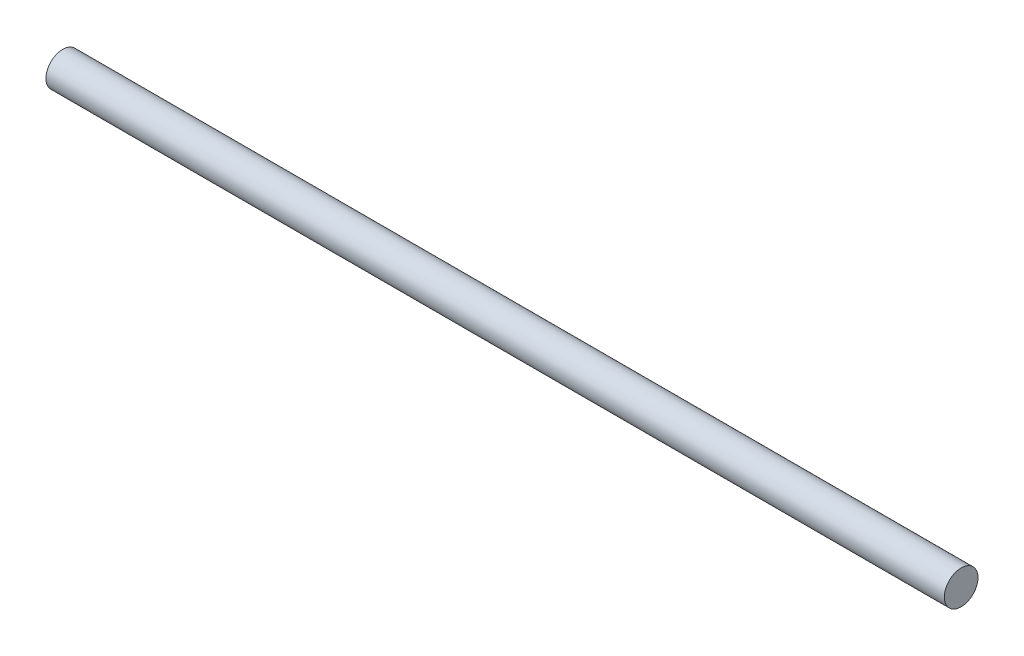
ISO-10303-21;
HEADER;
FILE_DESCRIPTION(('STEP AP214'),'2;1');
FILE_NAME('part.step','',(''),(''),'','','');
FILE_SCHEMA(('AUTOMOTIVE_DESIGN { 1 0 10303 214 1 1 1 1 }'));
ENDSEC;
DATA;
#1=APPLICATION_CONTEXT('core data for automotive mechanical design processes');
#2=APPLICATION_PROTOCOL_DEFINITION('international standard','automotive_design',2000,#1);
#3=PRODUCT_CONTEXT('',#1,'mechanical');
#4=PRODUCT('Part','Part','',(#3));
#5=PRODUCT_RELATED_PRODUCT_CATEGORY('part','',(#4));
#6=PRODUCT_DEFINITION_FORMATION('','',#4);
#7=PRODUCT_DEFINITION_CONTEXT('part definition',#1,'design');
#8=PRODUCT_DEFINITION('design','',#6,#7);
#9=PRODUCT_DEFINITION_SHAPE('','',#8);
#10=(LENGTH_UNIT() NAMED_UNIT(*) SI_UNIT(.MILLI.,.METRE.));
#11=(NAMED_UNIT(*) PLANE_ANGLE_UNIT() SI_UNIT($,.RADIAN.));
#12=(NAMED_UNIT(*) SI_UNIT($,.STERADIAN.) SOLID_ANGLE_UNIT());
#13=UNCERTAINTY_MEASURE_WITH_UNIT(LENGTH_MEASURE(1.E-05),#10,'distance_accuracy_value','');
#14=(GEOMETRIC_REPRESENTATION_CONTEXT(3) GLOBAL_UNCERTAINTY_ASSIGNED_CONTEXT((#13)) GLOBAL_UNIT_ASSIGNED_CONTEXT((#10,
#11,#12)) REPRESENTATION_CONTEXT('',''));
#15=CARTESIAN_POINT('',(0.,0.,0.));
#16=DIRECTION('',(0.,0.,1.));
#17=DIRECTION('',(1.,0.,0.));
#18=AXIS2_PLACEMENT_3D('',#15,#16,#17);
#19=CARTESIAN_POINT('',(0.,0.,0.));
#20=DIRECTION('',(1.,0.,0.));
#21=DIRECTION('',(0.,0.,-1.));
#22=AXIS2_PLACEMENT_3D('',#19,#20,#21);
#23=PLANE('',#22);
#24=CARTESIAN_POINT('',(0.,0.,0.));
#25=DIRECTION('',(1.,0.,0.));
#26=DIRECTION('',(0.,0.,-1.));
#27=AXIS2_PLACEMENT_3D('',#24,#25,#26);
#28=CIRCLE('',#27,0.1905);
#29=CARTESIAN_POINT('',(0.,0.,-0.1905));
#30=VERTEX_POINT('',#29);
#31=EDGE_CURVE('E43',#30,#30,#28,.T.);
#32=ORIENTED_EDGE('',*,*,#31,.F.);
#33=EDGE_LOOP('',(#32));
#34=FACE_BOUND('',#33,.T.);
#35=ADVANCED_FACE('F37',(#34),#23,.F.);
#36=CARTESIAN_POINT('',(10.16,0.,0.));
#37=DIRECTION('',(1.,0.,0.));
#38=DIRECTION('',(0.,0.,-1.));
#39=AXIS2_PLACEMENT_3D('',#36,#37,#38);
#40=PLANE('',#39);
#41=CARTESIAN_POINT('',(10.16,0.,0.));
#42=DIRECTION('',(1.,0.,0.));
#43=DIRECTION('',(0.,0.,-1.));
#44=AXIS2_PLACEMENT_3D('',#41,#42,#43);
#45=CIRCLE('',#44,0.1905);
#46=CARTESIAN_POINT('',(10.16,0.,-0.1905));
#47=VERTEX_POINT('',#46);
#48=EDGE_CURVE('E11',#47,#47,#45,.T.);
#49=ORIENTED_EDGE('',*,*,#48,.T.);
#50=EDGE_LOOP('',(#49));
#51=FACE_BOUND('',#50,.T.);
#52=ADVANCED_FACE('F52',(#51),#40,.T.);
#53=CARTESIAN_POINT('',(0.,0.,0.));
#54=DIRECTION('',(1.,0.,0.));
#55=DIRECTION('',(0.,0.,-1.));
#56=AXIS2_PLACEMENT_3D('',#53,#54,#55);
#57=CYLINDRICAL_SURFACE('',#56,0.1905);
#58=ORIENTED_EDGE('',*,*,#48,.F.);
#59=EDGE_LOOP('',(#58));
#60=FACE_BOUND('',#59,.T.);
#61=ORIENTED_EDGE('',*,*,#31,.T.);
#62=EDGE_LOOP('',(#61));
#63=FACE_BOUND('',#62,.T.);
#64=ADVANCED_FACE('F49',(#60,#63),#57,.T.);
#65=CLOSED_SHELL('',(#35,#52,#64));
#66=MANIFOLD_SOLID_BREP('B2',#65);
#67=ADVANCED_BREP_SHAPE_REPRESENTATION('',(#18,#66),#14);
#68=SHAPE_DEFINITION_REPRESENTATION(#9,#67);
ENDSEC;
END-ISO-10303-21;
